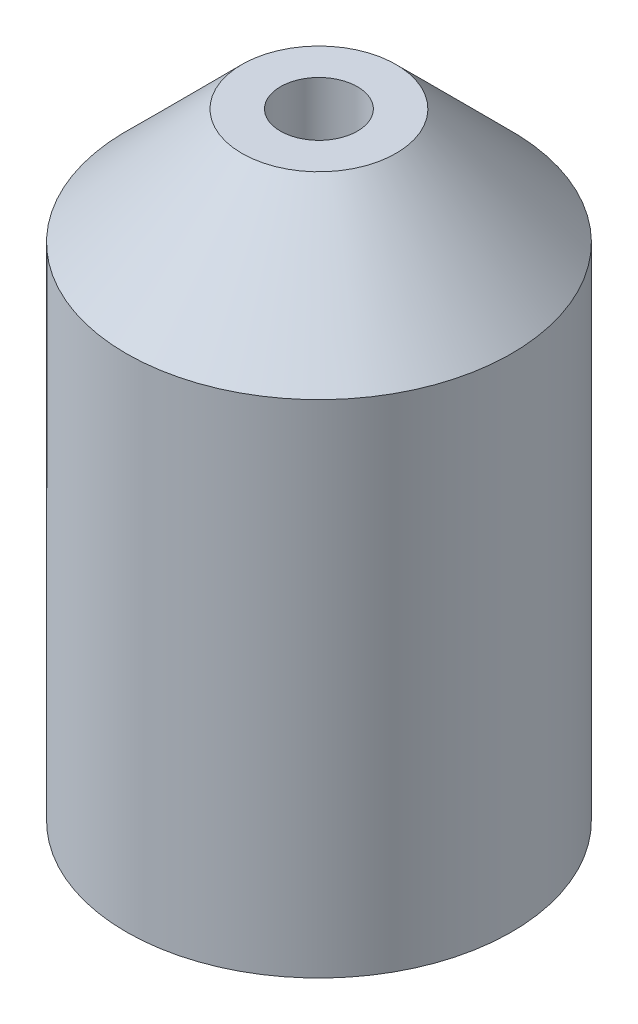
ISO-10303-21;
HEADER;
FILE_DESCRIPTION(('STEP AP214'),'2;1');
FILE_NAME('part.step','',(''),(''),'','','');
FILE_SCHEMA(('AUTOMOTIVE_DESIGN { 1 0 10303 214 1 1 1 1 }'));
ENDSEC;
DATA;
#1=APPLICATION_CONTEXT('core data for automotive mechanical design processes');
#2=APPLICATION_PROTOCOL_DEFINITION('international standard','automotive_design',2000,#1);
#3=PRODUCT_CONTEXT('',#1,'mechanical');
#4=PRODUCT('Part','Part','',(#3));
#5=PRODUCT_RELATED_PRODUCT_CATEGORY('part','',(#4));
#6=PRODUCT_DEFINITION_FORMATION('','',#4);
#7=PRODUCT_DEFINITION_CONTEXT('part definition',#1,'design');
#8=PRODUCT_DEFINITION('design','',#6,#7);
#9=PRODUCT_DEFINITION_SHAPE('','',#8);
#10=(LENGTH_UNIT() NAMED_UNIT(*) SI_UNIT(.MILLI.,.METRE.));
#11=(NAMED_UNIT(*) PLANE_ANGLE_UNIT() SI_UNIT($,.RADIAN.));
#12=(NAMED_UNIT(*) SI_UNIT($,.STERADIAN.) SOLID_ANGLE_UNIT());
#13=UNCERTAINTY_MEASURE_WITH_UNIT(LENGTH_MEASURE(1.E-05),#10,'distance_accuracy_value','');
#14=(GEOMETRIC_REPRESENTATION_CONTEXT(3) GLOBAL_UNCERTAINTY_ASSIGNED_CONTEXT((#13)) GLOBAL_UNIT_ASSIGNED_CONTEXT((#10,
#11,#12)) REPRESENTATION_CONTEXT('',''));
#15=CARTESIAN_POINT('',(0.,0.,0.));
#16=DIRECTION('',(0.,0.,1.));
#17=DIRECTION('',(1.,0.,0.));
#18=AXIS2_PLACEMENT_3D('',#15,#16,#17);
#19=CARTESIAN_POINT('',(0.,16.,0.));
#20=DIRECTION('',(0.,-1.,0.));
#21=DIRECTION('',(0.,0.,-1.));
#22=AXIS2_PLACEMENT_3D('',#19,#20,#21);
#23=CYLINDRICAL_SURFACE('',#22,5.);
#24=CARTESIAN_POINT('',(0.,13.,0.));
#25=DIRECTION('',(0.,1.,0.));
#26=DIRECTION('',(0.,0.,1.));
#27=AXIS2_PLACEMENT_3D('',#24,#25,#26);
#28=CIRCLE('',#27,5.);
#29=CARTESIAN_POINT('',(0.,13.,5.));
#30=VERTEX_POINT('',#29);
#31=EDGE_CURVE('E163',#30,#30,#28,.F.);
#32=ORIENTED_EDGE('',*,*,#31,.T.);
#33=EDGE_LOOP('',(#32));
#34=FACE_BOUND('',#33,.T.);
#35=CARTESIAN_POINT('',(0.,0.,0.));
#36=DIRECTION('',(0.,1.,0.));
#37=DIRECTION('',(0.,0.,1.));
#38=AXIS2_PLACEMENT_3D('',#35,#36,#37);
#39=CIRCLE('',#38,5.);
#40=CARTESIAN_POINT('',(0.,0.,5.));
#41=VERTEX_POINT('',#40);
#42=EDGE_CURVE('E155',#41,#41,#39,.T.);
#43=ORIENTED_EDGE('',*,*,#42,.T.);
#44=EDGE_LOOP('',(#43));
#45=FACE_BOUND('',#44,.T.);
#46=ADVANCED_FACE('F39',(#34,#45),#23,.T.);
#47=CARTESIAN_POINT('',(0.,16.,0.));
#48=DIRECTION('',(0.,1.,0.));
#49=DIRECTION('',(0.,0.,1.));
#50=AXIS2_PLACEMENT_3D('',#47,#48,#49);
#51=PLANE('',#50);
#52=CARTESIAN_POINT('',(0.,16.,0.));
#53=DIRECTION('',(0.,1.,0.));
#54=DIRECTION('',(0.,0.,1.));
#55=AXIS2_PLACEMENT_3D('',#52,#53,#54);
#56=CIRCLE('',#55,1.);
#57=CARTESIAN_POINT('',(0.,16.,1.));
#58=VERTEX_POINT('',#57);
#59=EDGE_CURVE('E145',#58,#58,#56,.T.);
#60=ORIENTED_EDGE('',*,*,#59,.F.);
#61=EDGE_LOOP('',(#60));
#62=FACE_BOUND('',#61,.T.);
#63=CARTESIAN_POINT('',(0.,16.,0.));
#64=DIRECTION('',(0.,1.,0.));
#65=DIRECTION('',(0.,0.,1.));
#66=AXIS2_PLACEMENT_3D('',#63,#64,#65);
#67=CIRCLE('',#66,2.);
#68=CARTESIAN_POINT('',(0.,16.,2.));
#69=VERTEX_POINT('',#68);
#70=EDGE_CURVE('E160',#69,#69,#67,.T.);
#71=ORIENTED_EDGE('',*,*,#70,.T.);
#72=EDGE_LOOP('',(#71));
#73=FACE_BOUND('',#72,.T.);
#74=ADVANCED_FACE('F249',(#62,#73),#51,.T.);
#75=CARTESIAN_POINT('',(0.,0.,0.));
#76=DIRECTION('',(0.,1.,0.));
#77=DIRECTION('',(0.,0.,1.));
#78=AXIS2_PLACEMENT_3D('',#75,#76,#77);
#79=PLANE('',#78);
#80=DIRECTION('',(-0.5,0.,-0.866025403784439));
#81=VECTOR('',#80,1.);
#82=CARTESIAN_POINT('',(-2.1650635094611,0.,3.75));
#83=LINE('',#82,#81);
#84=CARTESIAN_POINT('',(-2.1650635094611,0.,3.75));
#85=VERTEX_POINT('',#84);
#86=CARTESIAN_POINT('',(-4.33012701892219,0.,0.));
#87=VERTEX_POINT('',#86);
#88=EDGE_CURVE('E121',#85,#87,#83,.T.);
#89=ORIENTED_EDGE('',*,*,#88,.F.);
#90=DIRECTION('',(-1.,0.,0.));
#91=VECTOR('',#90,1.);
#92=CARTESIAN_POINT('',(2.1650635094611,0.,3.75));
#93=LINE('',#92,#91);
#94=CARTESIAN_POINT('',(2.1650635094611,0.,3.75));
#95=VERTEX_POINT('',#94);
#96=EDGE_CURVE('E126',#95,#85,#93,.T.);
#97=ORIENTED_EDGE('',*,*,#96,.F.);
#98=DIRECTION('',(-0.5,0.,0.866025403784439));
#99=VECTOR('',#98,1.);
#100=CARTESIAN_POINT('',(4.33012701892219,0.,0.));
#101=LINE('',#100,#99);
#102=CARTESIAN_POINT('',(4.33012701892219,0.,0.));
#103=VERTEX_POINT('',#102);
#104=EDGE_CURVE('E140',#103,#95,#101,.T.);
#105=ORIENTED_EDGE('',*,*,#104,.F.);
#106=DIRECTION('',(0.5,0.,0.866025403784439));
#107=VECTOR('',#106,1.);
#108=CARTESIAN_POINT('',(2.1650635094611,0.,-3.75));
#109=LINE('',#108,#107);
#110=CARTESIAN_POINT('',(2.1650635094611,0.,-3.75));
#111=VERTEX_POINT('',#110);
#112=EDGE_CURVE('E134',#111,#103,#109,.T.);
#113=ORIENTED_EDGE('',*,*,#112,.F.);
#114=DIRECTION('',(1.,0.,0.));
#115=VECTOR('',#114,1.);
#116=CARTESIAN_POINT('',(-2.1650635094611,0.,-3.75));
#117=LINE('',#116,#115);
#118=CARTESIAN_POINT('',(-2.1650635094611,0.,-3.75));
#119=VERTEX_POINT('',#118);
#120=EDGE_CURVE('E132',#119,#111,#117,.T.);
#121=ORIENTED_EDGE('',*,*,#120,.F.);
#122=DIRECTION('',(0.5,0.,-0.866025403784439));
#123=VECTOR('',#122,1.);
#124=CARTESIAN_POINT('',(-4.33012701892219,0.,0.));
#125=LINE('',#124,#123);
#126=EDGE_CURVE('E114',#87,#119,#125,.T.);
#127=ORIENTED_EDGE('',*,*,#126,.F.);
#128=EDGE_LOOP('',(#89,#97,#105,#113,#121,#127));
#129=FACE_BOUND('',#128,.T.);
#130=ORIENTED_EDGE('',*,*,#42,.F.);
#131=EDGE_LOOP('',(#130));
#132=FACE_BOUND('',#131,.T.);
#133=ADVANCED_FACE('F128',(#129,#132),#79,.F.);
#134=CARTESIAN_POINT('',(0.,16.,0.));
#135=DIRECTION('',(0.,-1.,0.));
#136=DIRECTION('',(0.,0.,-1.));
#137=AXIS2_PLACEMENT_3D('',#134,#135,#136);
#138=CONICAL_SURFACE('',#137,2.,0.785398163397446);
#139=ORIENTED_EDGE('',*,*,#31,.F.);
#140=EDGE_LOOP('',(#139));
#141=FACE_BOUND('',#140,.T.);
#142=ORIENTED_EDGE('',*,*,#70,.F.);
#143=EDGE_LOOP('',(#142));
#144=FACE_BOUND('',#143,.T.);
#145=ADVANCED_FACE('F261',(#141,#144),#138,.T.);
#146=CARTESIAN_POINT('',(0.,9.,0.));
#147=DIRECTION('',(0.,1.,0.));
#148=DIRECTION('',(0.,0.,1.));
#149=AXIS2_PLACEMENT_3D('',#146,#147,#148);
#150=CYLINDRICAL_SURFACE('',#149,1.);
#151=CARTESIAN_POINT('',(0.,9.,0.));
#152=DIRECTION('',(0.,1.,0.));
#153=DIRECTION('',(0.,0.,1.));
#154=AXIS2_PLACEMENT_3D('',#151,#152,#153);
#155=CIRCLE('',#154,1.);
#156=CARTESIAN_POINT('',(0.,9.,1.));
#157=VERTEX_POINT('',#156);
#158=EDGE_CURVE('E152',#157,#157,#155,.T.);
#159=ORIENTED_EDGE('',*,*,#158,.F.);
#160=EDGE_LOOP('',(#159));
#161=FACE_BOUND('',#160,.T.);
#162=ORIENTED_EDGE('',*,*,#59,.T.);
#163=EDGE_LOOP('',(#162));
#164=FACE_BOUND('',#163,.T.);
#165=ADVANCED_FACE('F266',(#161,#164),#150,.F.);
#166=CARTESIAN_POINT('',(0.,9.,0.));
#167=DIRECTION('',(0.,1.,0.));
#168=DIRECTION('',(0.,0.,1.));
#169=AXIS2_PLACEMENT_3D('',#166,#167,#168);
#170=PLANE('',#169);
#171=ORIENTED_EDGE('',*,*,#158,.T.);
#172=EDGE_LOOP('',(#171));
#173=FACE_BOUND('',#172,.T.);
#174=ADVANCED_FACE('F394',(#173),#170,.T.);
#175=CARTESIAN_POINT('',(2.1650635094611,7.,3.75));
#176=DIRECTION('',(0.,0.,1.));
#177=DIRECTION('',(1.,0.,0.));
#178=AXIS2_PLACEMENT_3D('',#175,#176,#177);
#179=PLANE('',#178);
#180=DIRECTION('',(0.,-1.,0.));
#181=VECTOR('',#180,1.);
#182=CARTESIAN_POINT('',(-2.1650635094611,7.,3.75));
#183=LINE('',#182,#181);
#184=CARTESIAN_POINT('',(-2.1650635094611,4.50000000000001,3.75));
#185=VERTEX_POINT('',#184);
#186=EDGE_CURVE('E118',#185,#85,#183,.T.);
#187=ORIENTED_EDGE('',*,*,#186,.F.);
#188=DIRECTION('',(1.,0.,0.));
#189=VECTOR('',#188,1.);
#190=CARTESIAN_POINT('',(2.1650635094611,4.50000000000001,3.75));
#191=LINE('',#190,#189);
#192=CARTESIAN_POINT('',(2.1650635094611,4.50000000000001,3.75));
#193=VERTEX_POINT('',#192);
#194=EDGE_CURVE('E11',#185,#193,#191,.T.);
#195=ORIENTED_EDGE('',*,*,#194,.T.);
#196=DIRECTION('',(0.,-1.,0.));
#197=VECTOR('',#196,1.);
#198=CARTESIAN_POINT('',(2.1650635094611,7.,3.75));
#199=LINE('',#198,#197);
#200=EDGE_CURVE('E143',#193,#95,#199,.T.);
#201=ORIENTED_EDGE('',*,*,#200,.T.);
#202=ORIENTED_EDGE('',*,*,#96,.T.);
#203=EDGE_LOOP('',(#187,#195,#201,#202));
#204=FACE_BOUND('',#203,.T.);
#205=ADVANCED_FACE('F207',(#204),#179,.F.);
#206=CARTESIAN_POINT('',(4.33012701892219,7.,0.));
#207=DIRECTION('',(0.866025403784439,0.,0.5));
#208=DIRECTION('',(0.5,0.,-0.866025403784439));
#209=AXIS2_PLACEMENT_3D('',#206,#207,#208);
#210=PLANE('',#209);
#211=ORIENTED_EDGE('',*,*,#200,.F.);
#212=DIRECTION('',(0.5,0.,-0.866025403784439));
#213=VECTOR('',#212,1.);
#214=CARTESIAN_POINT('',(4.33012701892219,4.50000000000001,0.));
#215=LINE('',#214,#213);
#216=CARTESIAN_POINT('',(4.33012701892219,4.50000000000001,0.));
#217=VERTEX_POINT('',#216);
#218=EDGE_CURVE('E179',#193,#217,#215,.T.);
#219=ORIENTED_EDGE('',*,*,#218,.T.);
#220=DIRECTION('',(0.,-1.,0.));
#221=VECTOR('',#220,1.);
#222=CARTESIAN_POINT('',(4.33012701892219,7.,0.));
#223=LINE('',#222,#221);
#224=EDGE_CURVE('E146',#217,#103,#223,.T.);
#225=ORIENTED_EDGE('',*,*,#224,.T.);
#226=ORIENTED_EDGE('',*,*,#104,.T.);
#227=EDGE_LOOP('',(#211,#219,#225,#226));
#228=FACE_BOUND('',#227,.T.);
#229=ADVANCED_FACE('F212',(#228),#210,.F.);
#230=CARTESIAN_POINT('',(2.1650635094611,7.,-3.75));
#231=DIRECTION('',(0.866025403784439,0.,-0.5));
#232=DIRECTION('',(-0.5,0.,-0.866025403784439));
#233=AXIS2_PLACEMENT_3D('',#230,#231,#232);
#234=PLANE('',#233);
#235=ORIENTED_EDGE('',*,*,#224,.F.);
#236=DIRECTION('',(-0.5,0.,-0.866025403784439));
#237=VECTOR('',#236,1.);
#238=CARTESIAN_POINT('',(2.1650635094611,4.50000000000001,-3.75));
#239=LINE('',#238,#237);
#240=CARTESIAN_POINT('',(2.1650635094611,4.50000000000001,-3.75));
#241=VERTEX_POINT('',#240);
#242=EDGE_CURVE('E182',#217,#241,#239,.T.);
#243=ORIENTED_EDGE('',*,*,#242,.T.);
#244=DIRECTION('',(0.,-1.,0.));
#245=VECTOR('',#244,1.);
#246=CARTESIAN_POINT('',(2.1650635094611,7.,-3.75));
#247=LINE('',#246,#245);
#248=EDGE_CURVE('E148',#241,#111,#247,.T.);
#249=ORIENTED_EDGE('',*,*,#248,.T.);
#250=ORIENTED_EDGE('',*,*,#112,.T.);
#251=EDGE_LOOP('',(#235,#243,#249,#250));
#252=FACE_BOUND('',#251,.T.);
#253=ADVANCED_FACE('F216',(#252),#234,.F.);
#254=CARTESIAN_POINT('',(-2.1650635094611,7.,-3.75));
#255=DIRECTION('',(0.,0.,-1.));
#256=DIRECTION('',(-1.,0.,0.));
#257=AXIS2_PLACEMENT_3D('',#254,#255,#256);
#258=PLANE('',#257);
#259=ORIENTED_EDGE('',*,*,#248,.F.);
#260=DIRECTION('',(-1.,0.,0.));
#261=VECTOR('',#260,1.);
#262=CARTESIAN_POINT('',(-2.1650635094611,4.50000000000001,-3.75));
#263=LINE('',#262,#261);
#264=CARTESIAN_POINT('',(-2.1650635094611,4.50000000000001,-3.75));
#265=VERTEX_POINT('',#264);
#266=EDGE_CURVE('E184',#241,#265,#263,.T.);
#267=ORIENTED_EDGE('',*,*,#266,.T.);
#268=DIRECTION('',(0.,-1.,0.));
#269=VECTOR('',#268,1.);
#270=CARTESIAN_POINT('',(-2.1650635094611,7.,-3.75));
#271=LINE('',#270,#269);
#272=EDGE_CURVE('E117',#265,#119,#271,.T.);
#273=ORIENTED_EDGE('',*,*,#272,.T.);
#274=ORIENTED_EDGE('',*,*,#120,.T.);
#275=EDGE_LOOP('',(#259,#267,#273,#274));
#276=FACE_BOUND('',#275,.T.);
#277=ADVANCED_FACE('F220',(#276),#258,.F.);
#278=CARTESIAN_POINT('',(-4.33012701892219,7.,0.));
#279=DIRECTION('',(-0.866025403784439,0.,-0.5));
#280=DIRECTION('',(-0.5,0.,0.866025403784439));
#281=AXIS2_PLACEMENT_3D('',#278,#279,#280);
#282=PLANE('',#281);
#283=ORIENTED_EDGE('',*,*,#272,.F.);
#284=DIRECTION('',(-0.5,0.,0.866025403784439));
#285=VECTOR('',#284,1.);
#286=CARTESIAN_POINT('',(-4.33012701892219,4.50000000000001,0.));
#287=LINE('',#286,#285);
#288=CARTESIAN_POINT('',(-4.33012701892219,4.50000000000001,0.));
#289=VERTEX_POINT('',#288);
#290=EDGE_CURVE('E64',#265,#289,#287,.T.);
#291=ORIENTED_EDGE('',*,*,#290,.T.);
#292=DIRECTION('',(0.,-1.,0.));
#293=VECTOR('',#292,1.);
#294=CARTESIAN_POINT('',(-4.33012701892219,7.,0.));
#295=LINE('',#294,#293);
#296=EDGE_CURVE('E110',#289,#87,#295,.T.);
#297=ORIENTED_EDGE('',*,*,#296,.T.);
#298=ORIENTED_EDGE('',*,*,#126,.T.);
#299=EDGE_LOOP('',(#283,#291,#297,#298));
#300=FACE_BOUND('',#299,.T.);
#301=ADVANCED_FACE('F112',(#300),#282,.F.);
#302=CARTESIAN_POINT('',(-2.1650635094611,7.,3.75));
#303=DIRECTION('',(-0.866025403784439,0.,0.5));
#304=DIRECTION('',(0.5,0.,0.866025403784439));
#305=AXIS2_PLACEMENT_3D('',#302,#303,#304);
#306=PLANE('',#305);
#307=ORIENTED_EDGE('',*,*,#296,.F.);
#308=DIRECTION('',(0.5,0.,0.866025403784439));
#309=VECTOR('',#308,1.);
#310=CARTESIAN_POINT('',(-2.1650635094611,4.50000000000001,3.75));
#311=LINE('',#310,#309);
#312=EDGE_CURVE('E49',#289,#185,#311,.T.);
#313=ORIENTED_EDGE('',*,*,#312,.T.);
#314=ORIENTED_EDGE('',*,*,#186,.T.);
#315=ORIENTED_EDGE('',*,*,#88,.T.);
#316=EDGE_LOOP('',(#307,#313,#314,#315));
#317=FACE_BOUND('',#316,.T.);
#318=ADVANCED_FACE('F122',(#317),#306,.F.);
#319=CARTESIAN_POINT('',(0.,7.,0.));
#320=DIRECTION('',(0.,-1.,0.));
#321=DIRECTION('',(0.,0.,-1.));
#322=AXIS2_PLACEMENT_3D('',#319,#320,#321);
#323=PLANE('',#322);
#324=DIRECTION('',(0.5,0.,0.866025403784439));
#325=VECTOR('',#324,1.);
#326=CARTESIAN_POINT('',(1.08253175473053,7.,-0.624999999999992));
#327=LINE('',#326,#325);
#328=CARTESIAN_POINT('',(0.721687836487023,7.,-1.24999999999998));
#329=VERTEX_POINT('',#328);
#330=CARTESIAN_POINT('',(1.44337567297405,7.,0.));
#331=VERTEX_POINT('',#330);
#332=EDGE_CURVE('E174',#329,#331,#327,.T.);
#333=ORIENTED_EDGE('',*,*,#332,.T.);
#334=DIRECTION('',(-0.5,0.,0.866025403784439));
#335=VECTOR('',#334,1.);
#336=CARTESIAN_POINT('',(1.08253175473054,7.,0.624999999999993));
#337=LINE('',#336,#335);
#338=CARTESIAN_POINT('',(0.721687836487025,7.,1.24999999999998));
#339=VERTEX_POINT('',#338);
#340=EDGE_CURVE('E176',#331,#339,#337,.T.);
#341=ORIENTED_EDGE('',*,*,#340,.T.);
#342=DIRECTION('',(-1.,0.,0.));
#343=VECTOR('',#342,1.);
#344=CARTESIAN_POINT('',(0.,7.,1.24999999999998));
#345=LINE('',#344,#343);
#346=CARTESIAN_POINT('',(-0.721687836487022,7.,1.24999999999998));
#347=VERTEX_POINT('',#346);
#348=EDGE_CURVE('E166',#339,#347,#345,.T.);
#349=ORIENTED_EDGE('',*,*,#348,.T.);
#350=DIRECTION('',(-0.5,0.,-0.866025403784439));
#351=VECTOR('',#350,1.);
#352=CARTESIAN_POINT('',(-1.08253175473053,7.,0.624999999999992));
#353=LINE('',#352,#351);
#354=CARTESIAN_POINT('',(-1.44337567297405,7.,0.));
#355=VERTEX_POINT('',#354);
#356=EDGE_CURVE('E168',#347,#355,#353,.T.);
#357=ORIENTED_EDGE('',*,*,#356,.T.);
#358=DIRECTION('',(0.5,0.,-0.866025403784439));
#359=VECTOR('',#358,1.);
#360=CARTESIAN_POINT('',(-1.08253175473053,7.,-0.624999999999992));
#361=LINE('',#360,#359);
#362=CARTESIAN_POINT('',(-0.721687836487024,7.,-1.24999999999998));
#363=VERTEX_POINT('',#362);
#364=EDGE_CURVE('E170',#355,#363,#361,.T.);
#365=ORIENTED_EDGE('',*,*,#364,.T.);
#366=DIRECTION('',(1.,0.,0.));
#367=VECTOR('',#366,1.);
#368=CARTESIAN_POINT('',(0.,7.,-1.24999999999998));
#369=LINE('',#368,#367);
#370=EDGE_CURVE('E172',#363,#329,#369,.T.);
#371=ORIENTED_EDGE('',*,*,#370,.T.);
#372=EDGE_LOOP('',(#333,#341,#349,#357,#365,#371));
#373=FACE_BOUND('',#372,.T.);
#374=ADVANCED_FACE('F239',(#373),#323,.T.);
#375=CARTESIAN_POINT('',(-1.08253175473053,7.,-0.624999999999991));
#376=DIRECTION('',(-0.612372435695791,0.707106781186551,-0.353553390593272));
#377=DIRECTION('',(0.5,0.,-0.866025403784439));
#378=AXIS2_PLACEMENT_3D('',#375,#376,#377);
#379=PLANE('',#378);
#380=DIRECTION('',(0.755928946018458,0.654653670707973,0.));
#381=VECTOR('',#380,1.);
#382=CARTESIAN_POINT('',(-1.23717914826347,7.17857142857143,0.));
#383=LINE('',#382,#381);
#384=EDGE_CURVE('E197',#289,#355,#383,.T.);
#385=ORIENTED_EDGE('',*,*,#384,.F.);
#386=ORIENTED_EDGE('',*,*,#290,.F.);
#387=DIRECTION('',(0.377964473009229,0.654653670707973,0.65465367070798));
#388=VECTOR('',#387,1.);
#389=CARTESIAN_POINT('',(-0.618589574131733,7.17857142857143,-1.07142857142855));
#390=LINE('',#389,#388);
#391=EDGE_CURVE('E44',#363,#265,#390,.F.);
#392=ORIENTED_EDGE('',*,*,#391,.F.);
#393=ORIENTED_EDGE('',*,*,#364,.F.);
#394=EDGE_LOOP('',(#385,#386,#392,#393));
#395=FACE_BOUND('',#394,.T.);
#396=ADVANCED_FACE('F42',(#395),#379,.F.);
#397=CARTESIAN_POINT('',(0.,7.,-1.24999999999998));
#398=DIRECTION('',(0.,0.707106781186551,-0.707106781186544));
#399=DIRECTION('',(1.,0.,0.));
#400=AXIS2_PLACEMENT_3D('',#397,#398,#399);
#401=PLANE('',#400);
#402=ORIENTED_EDGE('',*,*,#391,.T.);
#403=ORIENTED_EDGE('',*,*,#266,.F.);
#404=DIRECTION('',(-0.377964473009229,0.654653670707973,0.65465367070798));
#405=VECTOR('',#404,1.);
#406=CARTESIAN_POINT('',(0.618589574131733,7.17857142857143,-1.07142857142855));
#407=LINE('',#406,#405);
#408=EDGE_CURVE('E195',#329,#241,#407,.F.);
#409=ORIENTED_EDGE('',*,*,#408,.F.);
#410=ORIENTED_EDGE('',*,*,#370,.F.);
#411=EDGE_LOOP('',(#402,#403,#409,#410));
#412=FACE_BOUND('',#411,.T.);
#413=ADVANCED_FACE('F237',(#412),#401,.F.);
#414=CARTESIAN_POINT('',(-1.08253175473053,7.,0.624999999999992));
#415=DIRECTION('',(-0.612372435695791,0.707106781186552,0.353553390593272));
#416=DIRECTION('',(-0.5,0.,-0.866025403784439));
#417=AXIS2_PLACEMENT_3D('',#414,#415,#416);
#418=PLANE('',#417);
#419=ORIENTED_EDGE('',*,*,#384,.T.);
#420=ORIENTED_EDGE('',*,*,#356,.F.);
#421=DIRECTION('',(0.377964473009229,0.654653670707973,-0.65465367070798));
#422=VECTOR('',#421,1.);
#423=CARTESIAN_POINT('',(-0.618589574131732,7.17857142857143,1.07142857142856));
#424=LINE('',#423,#422);
#425=EDGE_CURVE('E192',#185,#347,#424,.T.);
#426=ORIENTED_EDGE('',*,*,#425,.F.);
#427=ORIENTED_EDGE('',*,*,#312,.F.);
#428=EDGE_LOOP('',(#419,#420,#426,#427));
#429=FACE_BOUND('',#428,.T.);
#430=ADVANCED_FACE('F223',(#429),#418,.F.);
#431=CARTESIAN_POINT('',(1.08253175473053,7.,-0.624999999999992));
#432=DIRECTION('',(0.612372435695791,0.707106781186551,-0.353553390593272));
#433=DIRECTION('',(0.5,0.,0.866025403784439));
#434=AXIS2_PLACEMENT_3D('',#431,#432,#433);
#435=PLANE('',#434);
#436=ORIENTED_EDGE('',*,*,#408,.T.);
#437=ORIENTED_EDGE('',*,*,#242,.F.);
#438=DIRECTION('',(-0.755928946018458,0.654653670707973,0.));
#439=VECTOR('',#438,1.);
#440=CARTESIAN_POINT('',(1.23717914826347,7.17857142857143,0.));
#441=LINE('',#440,#439);
#442=EDGE_CURVE('E190',#331,#217,#441,.F.);
#443=ORIENTED_EDGE('',*,*,#442,.F.);
#444=ORIENTED_EDGE('',*,*,#332,.F.);
#445=EDGE_LOOP('',(#436,#437,#443,#444));
#446=FACE_BOUND('',#445,.T.);
#447=ADVANCED_FACE('F235',(#446),#435,.F.);
#448=CARTESIAN_POINT('',(0.,7.,1.24999999999998));
#449=DIRECTION('',(0.,0.707106781186552,0.707106781186544));
#450=DIRECTION('',(-1.,0.,0.));
#451=AXIS2_PLACEMENT_3D('',#448,#449,#450);
#452=PLANE('',#451);
#453=ORIENTED_EDGE('',*,*,#425,.T.);
#454=ORIENTED_EDGE('',*,*,#348,.F.);
#455=DIRECTION('',(0.377964473009229,-0.654653670707973,0.65465367070798));
#456=VECTOR('',#455,1.);
#457=CARTESIAN_POINT('',(0.618589574131735,7.17857142857143,1.07142857142856));
#458=LINE('',#457,#456);
#459=EDGE_CURVE('E188',#193,#339,#458,.F.);
#460=ORIENTED_EDGE('',*,*,#459,.F.);
#461=ORIENTED_EDGE('',*,*,#194,.F.);
#462=EDGE_LOOP('',(#453,#454,#460,#461));
#463=FACE_BOUND('',#462,.T.);
#464=ADVANCED_FACE('F228',(#463),#452,.F.);
#465=CARTESIAN_POINT('',(1.08253175473054,7.,0.624999999999993));
#466=DIRECTION('',(0.612372435695791,0.707106781186551,0.353553390593272));
#467=DIRECTION('',(-0.5,0.,0.866025403784439));
#468=AXIS2_PLACEMENT_3D('',#465,#466,#467);
#469=PLANE('',#468);
#470=ORIENTED_EDGE('',*,*,#442,.T.);
#471=ORIENTED_EDGE('',*,*,#218,.F.);
#472=ORIENTED_EDGE('',*,*,#459,.T.);
#473=ORIENTED_EDGE('',*,*,#340,.F.);
#474=EDGE_LOOP('',(#470,#471,#472,#473));
#475=FACE_BOUND('',#474,.T.);
#476=ADVANCED_FACE('F231',(#475),#469,.F.);
#477=CLOSED_SHELL('',(#46,#74,#133,#145,#165,#174,#205,#229,#253,#277,#301,#318,#374,#396,#413,
#430,#447,#464,#476));
#478=MANIFOLD_SOLID_BREP('B2',#477);
#479=ADVANCED_BREP_SHAPE_REPRESENTATION('',(#18,#478),#14);
#480=SHAPE_DEFINITION_REPRESENTATION(#9,#479);
ENDSEC;
END-ISO-10303-21;
